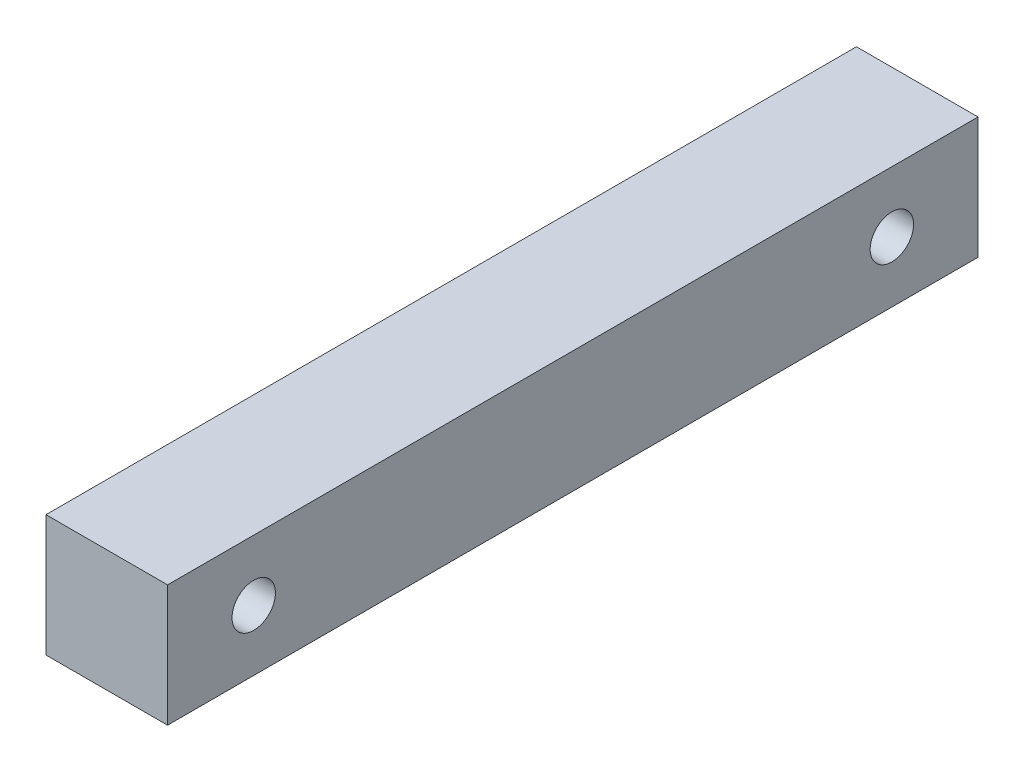
ISO-10303-21;
HEADER;
FILE_DESCRIPTION(('STEP AP214'),'2;1');
FILE_NAME('part.step','',(''),(''),'','','');
FILE_SCHEMA(('AUTOMOTIVE_DESIGN { 1 0 10303 214 1 1 1 1 }'));
ENDSEC;
DATA;
#1=APPLICATION_CONTEXT('core data for automotive mechanical design processes');
#2=APPLICATION_PROTOCOL_DEFINITION('international standard','automotive_design',2000,#1);
#3=PRODUCT_CONTEXT('',#1,'mechanical');
#4=PRODUCT('Part','Part','',(#3));
#5=PRODUCT_RELATED_PRODUCT_CATEGORY('part','',(#4));
#6=PRODUCT_DEFINITION_FORMATION('','',#4);
#7=PRODUCT_DEFINITION_CONTEXT('part definition',#1,'design');
#8=PRODUCT_DEFINITION('design','',#6,#7);
#9=PRODUCT_DEFINITION_SHAPE('','',#8);
#10=(LENGTH_UNIT() NAMED_UNIT(*) SI_UNIT(.MILLI.,.METRE.));
#11=(NAMED_UNIT(*) PLANE_ANGLE_UNIT() SI_UNIT($,.RADIAN.));
#12=(NAMED_UNIT(*) SI_UNIT($,.STERADIAN.) SOLID_ANGLE_UNIT());
#13=UNCERTAINTY_MEASURE_WITH_UNIT(LENGTH_MEASURE(1.E-05),#10,'distance_accuracy_value','');
#14=(GEOMETRIC_REPRESENTATION_CONTEXT(3) GLOBAL_UNCERTAINTY_ASSIGNED_CONTEXT((#13)) GLOBAL_UNIT_ASSIGNED_CONTEXT((#10,
#11,#12)) REPRESENTATION_CONTEXT('',''));
#15=CARTESIAN_POINT('',(0.,0.,0.));
#16=DIRECTION('',(0.,0.,1.));
#17=DIRECTION('',(1.,0.,0.));
#18=AXIS2_PLACEMENT_3D('',#15,#16,#17);
#19=CARTESIAN_POINT('',(9.525,-9.525,63.5));
#20=DIRECTION('',(-1.,0.,0.));
#21=DIRECTION('',(0.,0.,1.));
#22=AXIS2_PLACEMENT_3D('',#19,#20,#21);
#23=PLANE('',#22);
#24=CARTESIAN_POINT('',(9.525,0.,50.));
#25=DIRECTION('',(1.,0.,0.));
#26=DIRECTION('',(0.,0.,-1.));
#27=AXIS2_PLACEMENT_3D('',#24,#25,#26);
#28=CIRCLE('',#27,3.4);
#29=CARTESIAN_POINT('',(9.525,0.,46.6));
#30=VERTEX_POINT('',#29);
#31=EDGE_CURVE('E122',#30,#30,#28,.T.);
#32=ORIENTED_EDGE('',*,*,#31,.F.);
#33=EDGE_LOOP('',(#32));
#34=FACE_BOUND('',#33,.T.);
#35=CARTESIAN_POINT('',(9.525,0.,-50.));
#36=DIRECTION('',(1.,0.,0.));
#37=DIRECTION('',(0.,0.,-1.));
#38=AXIS2_PLACEMENT_3D('',#35,#36,#37);
#39=CIRCLE('',#38,3.4);
#40=CARTESIAN_POINT('',(9.525,0.,-53.4));
#41=VERTEX_POINT('',#40);
#42=EDGE_CURVE('E116',#41,#41,#39,.T.);
#43=ORIENTED_EDGE('',*,*,#42,.F.);
#44=EDGE_LOOP('',(#43));
#45=FACE_BOUND('',#44,.T.);
#46=DIRECTION('',(0.,1.,0.));
#47=VECTOR('',#46,1.);
#48=CARTESIAN_POINT('',(9.525,-9.525,-63.5));
#49=LINE('',#48,#47);
#50=CARTESIAN_POINT('',(9.525,-9.525,-63.5));
#51=VERTEX_POINT('',#50);
#52=CARTESIAN_POINT('',(9.525,9.525,-63.5));
#53=VERTEX_POINT('',#52);
#54=EDGE_CURVE('E100',#51,#53,#49,.T.);
#55=ORIENTED_EDGE('',*,*,#54,.T.);
#56=DIRECTION('',(0.,0.,-1.));
#57=VECTOR('',#56,1.);
#58=CARTESIAN_POINT('',(9.525,9.525,63.5));
#59=LINE('',#58,#57);
#60=CARTESIAN_POINT('',(9.525,9.525,63.5));
#61=VERTEX_POINT('',#60);
#62=EDGE_CURVE('E11',#61,#53,#59,.T.);
#63=ORIENTED_EDGE('',*,*,#62,.F.);
#64=DIRECTION('',(0.,1.,0.));
#65=VECTOR('',#64,1.);
#66=CARTESIAN_POINT('',(9.525,-9.525,63.5));
#67=LINE('',#66,#65);
#68=CARTESIAN_POINT('',(9.525,-9.525,63.5));
#69=VERTEX_POINT('',#68);
#70=EDGE_CURVE('E88',#69,#61,#67,.T.);
#71=ORIENTED_EDGE('',*,*,#70,.F.);
#72=DIRECTION('',(0.,0.,-1.));
#73=VECTOR('',#72,1.);
#74=CARTESIAN_POINT('',(9.525,-9.525,63.5));
#75=LINE('',#74,#73);
#76=EDGE_CURVE('E96',#69,#51,#75,.T.);
#77=ORIENTED_EDGE('',*,*,#76,.T.);
#78=EDGE_LOOP('',(#55,#63,#71,#77));
#79=FACE_BOUND('',#78,.T.);
#80=ADVANCED_FACE('F37',(#34,#45,#79),#23,.F.);
#81=CARTESIAN_POINT('',(-9.525,9.525,63.5));
#82=DIRECTION('',(0.,-1.,0.));
#83=DIRECTION('',(0.,0.,-1.));
#84=AXIS2_PLACEMENT_3D('',#81,#82,#83);
#85=PLANE('',#84);
#86=DIRECTION('',(-1.,0.,0.));
#87=VECTOR('',#86,1.);
#88=CARTESIAN_POINT('',(-9.525,9.525,-63.5));
#89=LINE('',#88,#87);
#90=CARTESIAN_POINT('',(-9.525,9.525,-63.5));
#91=VERTEX_POINT('',#90);
#92=EDGE_CURVE('E92',#53,#91,#89,.T.);
#93=ORIENTED_EDGE('',*,*,#92,.T.);
#94=DIRECTION('',(0.,0.,-1.));
#95=VECTOR('',#94,1.);
#96=CARTESIAN_POINT('',(-9.525,9.525,63.5));
#97=LINE('',#96,#95);
#98=CARTESIAN_POINT('',(-9.525,9.525,63.5));
#99=VERTEX_POINT('',#98);
#100=EDGE_CURVE('E45',#99,#91,#97,.T.);
#101=ORIENTED_EDGE('',*,*,#100,.F.);
#102=DIRECTION('',(-1.,0.,0.));
#103=VECTOR('',#102,1.);
#104=CARTESIAN_POINT('',(-9.525,9.525,63.5));
#105=LINE('',#104,#103);
#106=EDGE_CURVE('E83',#61,#99,#105,.T.);
#107=ORIENTED_EDGE('',*,*,#106,.F.);
#108=ORIENTED_EDGE('',*,*,#62,.T.);
#109=EDGE_LOOP('',(#93,#101,#107,#108));
#110=FACE_BOUND('',#109,.T.);
#111=ADVANCED_FACE('F91',(#110),#85,.F.);
#112=CARTESIAN_POINT('',(-9.525,-9.525,63.5));
#113=DIRECTION('',(1.,0.,0.));
#114=DIRECTION('',(0.,0.,-1.));
#115=AXIS2_PLACEMENT_3D('',#112,#113,#114);
#116=PLANE('',#115);
#117=CARTESIAN_POINT('',(-9.525,0.,50.));
#118=DIRECTION('',(1.,0.,0.));
#119=DIRECTION('',(0.,0.,-1.));
#120=AXIS2_PLACEMENT_3D('',#117,#118,#119);
#121=CIRCLE('',#120,3.4);
#122=CARTESIAN_POINT('',(-9.525,0.,46.6));
#123=VERTEX_POINT('',#122);
#124=EDGE_CURVE('E119',#123,#123,#121,.T.);
#125=ORIENTED_EDGE('',*,*,#124,.T.);
#126=EDGE_LOOP('',(#125));
#127=FACE_BOUND('',#126,.T.);
#128=CARTESIAN_POINT('',(-9.525,0.,-50.));
#129=DIRECTION('',(1.,0.,0.));
#130=DIRECTION('',(0.,0.,-1.));
#131=AXIS2_PLACEMENT_3D('',#128,#129,#130);
#132=CIRCLE('',#131,3.4);
#133=CARTESIAN_POINT('',(-9.525,0.,-53.4));
#134=VERTEX_POINT('',#133);
#135=EDGE_CURVE('E103',#134,#134,#132,.T.);
#136=ORIENTED_EDGE('',*,*,#135,.T.);
#137=EDGE_LOOP('',(#136));
#138=FACE_BOUND('',#137,.T.);
#139=DIRECTION('',(0.,-1.,0.));
#140=VECTOR('',#139,1.);
#141=CARTESIAN_POINT('',(-9.525,-9.525,-63.5));
#142=LINE('',#141,#140);
#143=CARTESIAN_POINT('',(-9.525,-9.525,-63.5));
#144=VERTEX_POINT('',#143);
#145=EDGE_CURVE('E70',#91,#144,#142,.T.);
#146=ORIENTED_EDGE('',*,*,#145,.T.);
#147=DIRECTION('',(0.,0.,-1.));
#148=VECTOR('',#147,1.);
#149=CARTESIAN_POINT('',(-9.525,-9.525,63.5));
#150=LINE('',#149,#148);
#151=CARTESIAN_POINT('',(-9.525,-9.525,63.5));
#152=VERTEX_POINT('',#151);
#153=EDGE_CURVE('E93',#152,#144,#150,.T.);
#154=ORIENTED_EDGE('',*,*,#153,.F.);
#155=DIRECTION('',(0.,-1.,0.));
#156=VECTOR('',#155,1.);
#157=CARTESIAN_POINT('',(-9.525,-9.525,63.5));
#158=LINE('',#157,#156);
#159=EDGE_CURVE('E86',#99,#152,#158,.T.);
#160=ORIENTED_EDGE('',*,*,#159,.F.);
#161=ORIENTED_EDGE('',*,*,#100,.T.);
#162=EDGE_LOOP('',(#146,#154,#160,#161));
#163=FACE_BOUND('',#162,.T.);
#164=ADVANCED_FACE('F94',(#127,#138,#163),#116,.F.);
#165=CARTESIAN_POINT('',(-9.525,-9.525,63.5));
#166=DIRECTION('',(0.,1.,0.));
#167=DIRECTION('',(0.,0.,1.));
#168=AXIS2_PLACEMENT_3D('',#165,#166,#167);
#169=PLANE('',#168);
#170=DIRECTION('',(1.,0.,0.));
#171=VECTOR('',#170,1.);
#172=CARTESIAN_POINT('',(-9.525,-9.525,-63.5));
#173=LINE('',#172,#171);
#174=EDGE_CURVE('E76',#144,#51,#173,.T.);
#175=ORIENTED_EDGE('',*,*,#174,.T.);
#176=ORIENTED_EDGE('',*,*,#76,.F.);
#177=DIRECTION('',(1.,0.,0.));
#178=VECTOR('',#177,1.);
#179=CARTESIAN_POINT('',(-9.525,-9.525,63.5));
#180=LINE('',#179,#178);
#181=EDGE_CURVE('E53',#152,#69,#180,.T.);
#182=ORIENTED_EDGE('',*,*,#181,.F.);
#183=ORIENTED_EDGE('',*,*,#153,.T.);
#184=EDGE_LOOP('',(#175,#176,#182,#183));
#185=FACE_BOUND('',#184,.T.);
#186=ADVANCED_FACE('F108',(#185),#169,.F.);
#187=CARTESIAN_POINT('',(0.,0.,63.5));
#188=DIRECTION('',(0.,0.,-1.));
#189=DIRECTION('',(-1.,0.,0.));
#190=AXIS2_PLACEMENT_3D('',#187,#188,#189);
#191=PLANE('',#190);
#192=ORIENTED_EDGE('',*,*,#70,.T.);
#193=ORIENTED_EDGE('',*,*,#106,.T.);
#194=ORIENTED_EDGE('',*,*,#159,.T.);
#195=ORIENTED_EDGE('',*,*,#181,.T.);
#196=EDGE_LOOP('',(#192,#193,#194,#195));
#197=FACE_BOUND('',#196,.T.);
#198=ADVANCED_FACE('F84',(#197),#191,.F.);
#199=CARTESIAN_POINT('',(0.,0.,-63.5));
#200=DIRECTION('',(0.,0.,-1.));
#201=DIRECTION('',(-1.,0.,0.));
#202=AXIS2_PLACEMENT_3D('',#199,#200,#201);
#203=PLANE('',#202);
#204=ORIENTED_EDGE('',*,*,#54,.F.);
#205=ORIENTED_EDGE('',*,*,#174,.F.);
#206=ORIENTED_EDGE('',*,*,#145,.F.);
#207=ORIENTED_EDGE('',*,*,#92,.F.);
#208=EDGE_LOOP('',(#204,#205,#206,#207));
#209=FACE_BOUND('',#208,.T.);
#210=ADVANCED_FACE('F111',(#209),#203,.T.);
#211=CARTESIAN_POINT('',(9.525,0.,-50.));
#212=DIRECTION('',(1.,0.,0.));
#213=DIRECTION('',(0.,0.,-1.));
#214=AXIS2_PLACEMENT_3D('',#211,#212,#213);
#215=CYLINDRICAL_SURFACE('',#214,3.4);
#216=ORIENTED_EDGE('',*,*,#135,.F.);
#217=EDGE_LOOP('',(#216));
#218=FACE_BOUND('',#217,.T.);
#219=ORIENTED_EDGE('',*,*,#42,.T.);
#220=EDGE_LOOP('',(#219));
#221=FACE_BOUND('',#220,.T.);
#222=ADVANCED_FACE('F132',(#218,#221),#215,.F.);
#223=CARTESIAN_POINT('',(9.525,0.,50.));
#224=DIRECTION('',(1.,0.,0.));
#225=DIRECTION('',(0.,0.,-1.));
#226=AXIS2_PLACEMENT_3D('',#223,#224,#225);
#227=CYLINDRICAL_SURFACE('',#226,3.4);
#228=ORIENTED_EDGE('',*,*,#124,.F.);
#229=EDGE_LOOP('',(#228));
#230=FACE_BOUND('',#229,.T.);
#231=ORIENTED_EDGE('',*,*,#31,.T.);
#232=EDGE_LOOP('',(#231));
#233=FACE_BOUND('',#232,.T.);
#234=ADVANCED_FACE('F126',(#230,#233),#227,.F.);
#235=CLOSED_SHELL('',(#80,#111,#164,#186,#198,#210,#222,#234));
#236=MANIFOLD_SOLID_BREP('B2',#235);
#237=ADVANCED_BREP_SHAPE_REPRESENTATION('',(#18,#236),#14);
#238=SHAPE_DEFINITION_REPRESENTATION(#9,#237);
ENDSEC;
END-ISO-10303-21;
